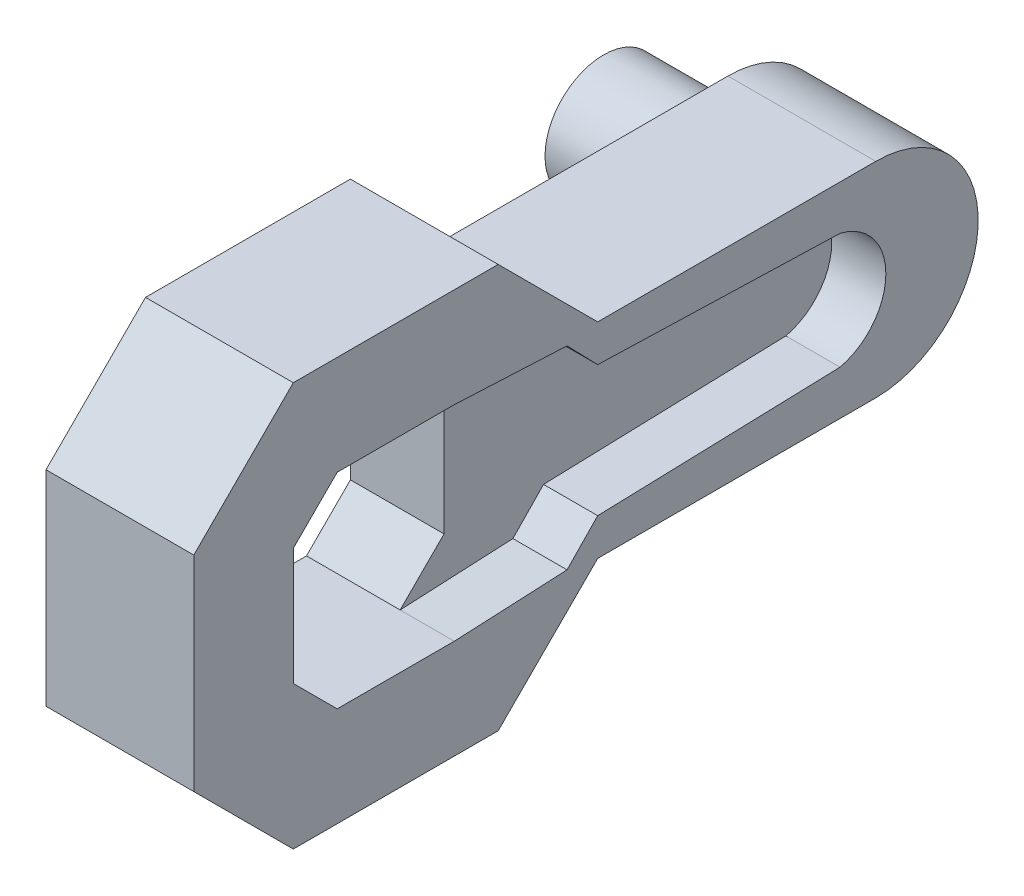
ISO-10303-21;
HEADER;
FILE_DESCRIPTION(('STEP AP214'),'2;1');
FILE_NAME('part.step','',(''),(''),'','','');
FILE_SCHEMA(('AUTOMOTIVE_DESIGN { 1 0 10303 214 1 1 1 1 }'));
ENDSEC;
DATA;
#1=APPLICATION_CONTEXT('core data for automotive mechanical design processes');
#2=APPLICATION_PROTOCOL_DEFINITION('international standard','automotive_design',2000,#1);
#3=PRODUCT_CONTEXT('',#1,'mechanical');
#4=PRODUCT('Part','Part','',(#3));
#5=PRODUCT_RELATED_PRODUCT_CATEGORY('part','',(#4));
#6=PRODUCT_DEFINITION_FORMATION('','',#4);
#7=PRODUCT_DEFINITION_CONTEXT('part definition',#1,'design');
#8=PRODUCT_DEFINITION('design','',#6,#7);
#9=PRODUCT_DEFINITION_SHAPE('','',#8);
#10=(LENGTH_UNIT() NAMED_UNIT(*) SI_UNIT(.MILLI.,.METRE.));
#11=(NAMED_UNIT(*) PLANE_ANGLE_UNIT() SI_UNIT($,.RADIAN.));
#12=(NAMED_UNIT(*) SI_UNIT($,.STERADIAN.) SOLID_ANGLE_UNIT());
#13=UNCERTAINTY_MEASURE_WITH_UNIT(LENGTH_MEASURE(1.E-05),#10,'distance_accuracy_value','');
#14=(GEOMETRIC_REPRESENTATION_CONTEXT(3) GLOBAL_UNCERTAINTY_ASSIGNED_CONTEXT((#13)) GLOBAL_UNIT_ASSIGNED_CONTEXT((#10,
#11,#12)) REPRESENTATION_CONTEXT('',''));
#15=CARTESIAN_POINT('',(0.,0.,0.));
#16=DIRECTION('',(0.,0.,1.));
#17=DIRECTION('',(1.,0.,0.));
#18=AXIS2_PLACEMENT_3D('',#15,#16,#17);
#19=CARTESIAN_POINT('',(3.2,0.,0.));
#20=DIRECTION('',(1.,0.,0.));
#21=DIRECTION('',(0.,0.,-1.));
#22=AXIS2_PLACEMENT_3D('',#19,#20,#21);
#23=PLANE('',#22);
#24=DIRECTION('',(0.,0.707106781186544,-0.707106781186551));
#25=VECTOR('',#24,1.);
#26=CARTESIAN_POINT('',(3.2,-3.5,-1.99999999999999));
#27=LINE('',#26,#25);
#28=CARTESIAN_POINT('',(3.2,-2.00000000000001,-3.5));
#29=VERTEX_POINT('',#28);
#30=CARTESIAN_POINT('',(3.2,-3.5,-1.99999999999999));
#31=VERTEX_POINT('',#30);
#32=EDGE_CURVE('E400',#29,#31,#27,.F.);
#33=ORIENTED_EDGE('',*,*,#32,.T.);
#34=DIRECTION('',(0.,-0.0481321510759977,0.998840976348486));
#35=VECTOR('',#34,1.);
#36=CARTESIAN_POINT('',(3.2,-3.58804426566379,-0.172900684645164));
#37=LINE('',#36,#35);
#38=CARTESIAN_POINT('',(3.2,-3.31433472381521,-5.85293575276977));
#39=VERTEX_POINT('',#38);
#40=EDGE_CURVE('E249',#39,#31,#37,.T.);
#41=ORIENTED_EDGE('',*,*,#40,.F.);
#42=DIRECTION('',(0.,-0.717900092453598,0.696146146477243));
#43=VECTOR('',#42,1.);
#44=CARTESIAN_POINT('',(3.2,-2.23455065304895,-6.90000000000001));
#45=LINE('',#44,#43);
#46=CARTESIAN_POINT('',(3.2,-2.23455065304895,-6.90000000000001));
#47=VERTEX_POINT('',#46);
#48=EDGE_CURVE('E301',#47,#39,#45,.T.);
#49=ORIENTED_EDGE('',*,*,#48,.F.);
#50=DIRECTION('',(0.,-0.0307610854897689,0.999526765834458));
#51=VECTOR('',#50,1.);
#52=CARTESIAN_POINT('',(3.2,-2.23455065304895,-6.90000000000001));
#53=LINE('',#52,#51);
#54=CARTESIAN_POINT('',(3.2,-1.97976035461889,-15.1789576148247));
#55=VERTEX_POINT('',#54);
#56=EDGE_CURVE('E317',#55,#47,#53,.T.);
#57=ORIENTED_EDGE('',*,*,#56,.F.);
#58=CARTESIAN_POINT('',(3.2,0.,-14.7117047366577));
#59=DIRECTION('',(-1.,0.,0.));
#60=DIRECTION('',(0.,0.,-1.));
#61=AXIS2_PLACEMENT_3D('',#58,#59,#60);
#62=CIRCLE('',#61,2.03415248048815);
#63=CARTESIAN_POINT('',(3.2,1.97976035461889,-15.1789576148247));
#64=VERTEX_POINT('',#63);
#65=EDGE_CURVE('E315',#64,#55,#62,.T.);
#66=ORIENTED_EDGE('',*,*,#65,.F.);
#67=DIRECTION('',(0.,-0.0307610854897688,-0.999526765834458));
#68=VECTOR('',#67,1.);
#69=CARTESIAN_POINT('',(3.2,2.23455065304895,-6.90000000000001));
#70=LINE('',#69,#68);
#71=CARTESIAN_POINT('',(3.2,2.23455065304895,-6.90000000000001));
#72=VERTEX_POINT('',#71);
#73=EDGE_CURVE('E313',#72,#64,#70,.T.);
#74=ORIENTED_EDGE('',*,*,#73,.F.);
#75=DIRECTION('',(0.,-0.717900092453598,-0.696146146477243));
#76=VECTOR('',#75,1.);
#77=CARTESIAN_POINT('',(3.2,2.23455065304895,-6.90000000000001));
#78=LINE('',#77,#76);
#79=CARTESIAN_POINT('',(3.2,3.31433472381521,-5.85293575276977));
#80=VERTEX_POINT('',#79);
#81=EDGE_CURVE('E296',#80,#72,#78,.T.);
#82=ORIENTED_EDGE('',*,*,#81,.F.);
#83=DIRECTION('',(0.,0.0481321510759978,0.998840976348486));
#84=VECTOR('',#83,1.);
#85=CARTESIAN_POINT('',(3.2,3.5880442656638,-0.172900684645164));
#86=LINE('',#85,#84);
#87=CARTESIAN_POINT('',(3.2,3.5,-2.00000000000001));
#88=VERTEX_POINT('',#87);
#89=EDGE_CURVE('E246',#80,#88,#86,.T.);
#90=ORIENTED_EDGE('',*,*,#89,.T.);
#91=DIRECTION('',(0.,0.707106781186551,0.707106781186544));
#92=VECTOR('',#91,1.);
#93=CARTESIAN_POINT('',(3.2,2.,-3.5));
#94=LINE('',#93,#92);
#95=CARTESIAN_POINT('',(3.2,2.,-3.5));
#96=VERTEX_POINT('',#95);
#97=EDGE_CURVE('E396',#88,#96,#94,.F.);
#98=ORIENTED_EDGE('',*,*,#97,.T.);
#99=DIRECTION('',(0.,1.,0.));
#100=VECTOR('',#99,1.);
#101=CARTESIAN_POINT('',(3.2,-3.5,-3.5));
#102=LINE('',#101,#100);
#103=EDGE_CURVE('E340',#29,#96,#102,.T.);
#104=ORIENTED_EDGE('',*,*,#103,.F.);
#105=EDGE_LOOP('',(#33,#41,#49,#57,#66,#74,#82,#90,#98,#104));
#106=FACE_BOUND('',#105,.T.);
#107=ADVANCED_FACE('F44',(#106),#23,.T.);
#108=CARTESIAN_POINT('',(0.,0.,0.));
#109=DIRECTION('',(1.,0.,0.));
#110=DIRECTION('',(0.,0.,-1.));
#111=AXIS2_PLACEMENT_3D('',#108,#109,#110);
#112=PLANE('',#111);
#113=CARTESIAN_POINT('',(0.,0.,-16.4));
#114=DIRECTION('',(1.,0.,0.));
#115=DIRECTION('',(0.,0.,-1.));
#116=AXIS2_PLACEMENT_3D('',#113,#114,#115);
#117=CIRCLE('',#116,2.);
#118=CARTESIAN_POINT('',(0.,0.,-18.4));
#119=VERTEX_POINT('',#118);
#120=EDGE_CURVE('E11',#119,#119,#117,.F.);
#121=ORIENTED_EDGE('',*,*,#120,.F.);
#122=EDGE_LOOP('',(#121));
#123=FACE_BOUND('',#122,.T.);
#124=DIRECTION('',(0.,0.,-1.));
#125=VECTOR('',#124,1.);
#126=CARTESIAN_POINT('',(0.,-3.5,-6.90000000000001));
#127=LINE('',#126,#125);
#128=CARTESIAN_POINT('',(0.,-3.5,-6.90000000000001));
#129=VERTEX_POINT('',#128);
#130=CARTESIAN_POINT('',(0.,-3.5,-16.4));
#131=VERTEX_POINT('',#130);
#132=EDGE_CURVE('E362',#129,#131,#127,.T.);
#133=ORIENTED_EDGE('',*,*,#132,.F.);
#134=DIRECTION('',(0.,0.707106781186546,-0.707106781186549));
#135=VECTOR('',#134,1.);
#136=CARTESIAN_POINT('',(0.,-3.5,-6.90000000000001));
#137=LINE('',#136,#135);
#138=CARTESIAN_POINT('',(0.,-6.9,-3.49999999999999));
#139=VERTEX_POINT('',#138);
#140=EDGE_CURVE('E230',#129,#139,#137,.F.);
#141=ORIENTED_EDGE('',*,*,#140,.T.);
#142=DIRECTION('',(0.,0.,-1.));
#143=VECTOR('',#142,1.);
#144=CARTESIAN_POINT('',(0.,-6.9,6.9));
#145=LINE('',#144,#143);
#146=CARTESIAN_POINT('',(0.,-6.9,3.5));
#147=VERTEX_POINT('',#146);
#148=EDGE_CURVE('E360',#147,#139,#145,.T.);
#149=ORIENTED_EDGE('',*,*,#148,.F.);
#150=DIRECTION('',(0.,-0.707106781186549,-0.707106781186546));
#151=VECTOR('',#150,1.);
#152=CARTESIAN_POINT('',(0.,-6.9,3.5));
#153=LINE('',#152,#151);
#154=CARTESIAN_POINT('',(0.,-3.49999999999999,6.9));
#155=VERTEX_POINT('',#154);
#156=EDGE_CURVE('E225',#147,#155,#153,.F.);
#157=ORIENTED_EDGE('',*,*,#156,.T.);
#158=DIRECTION('',(0.,-1.,0.));
#159=VECTOR('',#158,1.);
#160=CARTESIAN_POINT('',(0.,-6.9,6.9));
#161=LINE('',#160,#159);
#162=CARTESIAN_POINT('',(0.,3.5,6.9));
#163=VERTEX_POINT('',#162);
#164=EDGE_CURVE('E357',#163,#155,#161,.T.);
#165=ORIENTED_EDGE('',*,*,#164,.F.);
#166=DIRECTION('',(0.,-0.707106781186546,0.707106781186549));
#167=VECTOR('',#166,1.);
#168=CARTESIAN_POINT('',(0.,3.50000000000001,6.9));
#169=LINE('',#168,#167);
#170=CARTESIAN_POINT('',(0.,6.9,3.49999999999999));
#171=VERTEX_POINT('',#170);
#172=EDGE_CURVE('E60',#163,#171,#169,.F.);
#173=ORIENTED_EDGE('',*,*,#172,.T.);
#174=DIRECTION('',(0.,0.,1.));
#175=VECTOR('',#174,1.);
#176=CARTESIAN_POINT('',(0.,6.9,6.9));
#177=LINE('',#176,#175);
#178=CARTESIAN_POINT('',(0.,6.9,-3.50000000000001));
#179=VERTEX_POINT('',#178);
#180=EDGE_CURVE('E343',#179,#171,#177,.T.);
#181=ORIENTED_EDGE('',*,*,#180,.F.);
#182=DIRECTION('',(0.,0.707106781186548,0.707106781186547));
#183=VECTOR('',#182,1.);
#184=CARTESIAN_POINT('',(0.,6.9,-3.50000000000001));
#185=LINE('',#184,#183);
#186=CARTESIAN_POINT('',(0.,3.5,-6.90000000000001));
#187=VERTEX_POINT('',#186);
#188=EDGE_CURVE('E68',#179,#187,#185,.F.);
#189=ORIENTED_EDGE('',*,*,#188,.T.);
#190=DIRECTION('',(0.,0.,1.));
#191=VECTOR('',#190,1.);
#192=CARTESIAN_POINT('',(0.,3.5,-6.90000000000001));
#193=LINE('',#192,#191);
#194=CARTESIAN_POINT('',(0.,3.5,-16.4));
#195=VERTEX_POINT('',#194);
#196=EDGE_CURVE('E365',#195,#187,#193,.T.);
#197=ORIENTED_EDGE('',*,*,#196,.F.);
#198=CARTESIAN_POINT('',(0.,0.,-16.4));
#199=DIRECTION('',(1.,0.,0.));
#200=DIRECTION('',(0.,0.,-1.));
#201=AXIS2_PLACEMENT_3D('',#198,#199,#200);
#202=CIRCLE('',#201,3.5);
#203=CARTESIAN_POINT('',(0.,0.,-19.9));
#204=VERTEX_POINT('',#203);
#205=EDGE_CURVE('E407',#195,#204,#202,.F.);
#206=ORIENTED_EDGE('',*,*,#205,.T.);
#207=CARTESIAN_POINT('',(0.,0.,-16.4));
#208=DIRECTION('',(1.,0.,0.));
#209=DIRECTION('',(0.,0.,-1.));
#210=AXIS2_PLACEMENT_3D('',#207,#208,#209);
#211=CIRCLE('',#210,3.5);
#212=EDGE_CURVE('E409',#204,#131,#211,.F.);
#213=ORIENTED_EDGE('',*,*,#212,.T.);
#214=EDGE_LOOP('',(#133,#141,#149,#157,#165,#173,#181,#189,#197,#206,#213));
#215=FACE_BOUND('',#214,.T.);
#216=DIRECTION('',(0.,0.,-1.));
#217=VECTOR('',#216,1.);
#218=CARTESIAN_POINT('',(0.,-3.5,3.5));
#219=LINE('',#218,#217);
#220=CARTESIAN_POINT('',(0.,-3.5,2.));
#221=VERTEX_POINT('',#220);
#222=CARTESIAN_POINT('',(0.,-3.5,-1.99999999999999));
#223=VERTEX_POINT('',#222);
#224=EDGE_CURVE('E344',#221,#223,#219,.T.);
#225=ORIENTED_EDGE('',*,*,#224,.T.);
#226=DIRECTION('',(0.,-0.707106781186544,0.707106781186551));
#227=VECTOR('',#226,1.);
#228=CARTESIAN_POINT('',(0.,-2.75000000000001,-2.74999999999999));
#229=LINE('',#228,#227);
#230=CARTESIAN_POINT('',(0.,-2.00000000000001,-3.5));
#231=VERTEX_POINT('',#230);
#232=EDGE_CURVE('E398',#223,#231,#229,.F.);
#233=ORIENTED_EDGE('',*,*,#232,.T.);
#234=DIRECTION('',(0.,1.,0.));
#235=VECTOR('',#234,1.);
#236=CARTESIAN_POINT('',(0.,-3.5,-3.5));
#237=LINE('',#236,#235);
#238=CARTESIAN_POINT('',(0.,2.,-3.5));
#239=VERTEX_POINT('',#238);
#240=EDGE_CURVE('E345',#231,#239,#237,.T.);
#241=ORIENTED_EDGE('',*,*,#240,.T.);
#242=DIRECTION('',(0.,-0.707106781186551,-0.707106781186544));
#243=VECTOR('',#242,1.);
#244=CARTESIAN_POINT('',(0.,2.74999999999999,-2.75000000000001));
#245=LINE('',#244,#243);
#246=CARTESIAN_POINT('',(0.,3.5,-2.00000000000001));
#247=VERTEX_POINT('',#246);
#248=EDGE_CURVE('E394',#239,#247,#245,.F.);
#249=ORIENTED_EDGE('',*,*,#248,.T.);
#250=DIRECTION('',(0.,0.,1.));
#251=VECTOR('',#250,1.);
#252=CARTESIAN_POINT('',(0.,3.5,3.5));
#253=LINE('',#252,#251);
#254=CARTESIAN_POINT('',(0.,3.5,1.99999999999999));
#255=VERTEX_POINT('',#254);
#256=EDGE_CURVE('E348',#247,#255,#253,.T.);
#257=ORIENTED_EDGE('',*,*,#256,.T.);
#258=DIRECTION('',(0.,0.707106781186544,-0.707106781186551));
#259=VECTOR('',#258,1.);
#260=CARTESIAN_POINT('',(0.,2.75000000000001,2.74999999999999));
#261=LINE('',#260,#259);
#262=CARTESIAN_POINT('',(0.,2.00000000000001,3.5));
#263=VERTEX_POINT('',#262);
#264=EDGE_CURVE('E405',#255,#263,#261,.F.);
#265=ORIENTED_EDGE('',*,*,#264,.T.);
#266=DIRECTION('',(0.,-1.,0.));
#267=VECTOR('',#266,1.);
#268=CARTESIAN_POINT('',(0.,-3.5,3.5));
#269=LINE('',#268,#267);
#270=CARTESIAN_POINT('',(0.,-1.99999999999999,3.5));
#271=VERTEX_POINT('',#270);
#272=EDGE_CURVE('E351',#263,#271,#269,.T.);
#273=ORIENTED_EDGE('',*,*,#272,.T.);
#274=DIRECTION('',(0.,0.707106781186551,0.707106781186544));
#275=VECTOR('',#274,1.);
#276=CARTESIAN_POINT('',(0.,-2.74999999999999,2.75000000000001));
#277=LINE('',#276,#275);
#278=EDGE_CURVE('E403',#271,#221,#277,.F.);
#279=ORIENTED_EDGE('',*,*,#278,.T.);
#280=EDGE_LOOP('',(#225,#233,#241,#249,#257,#265,#273,#279));
#281=FACE_BOUND('',#280,.T.);
#282=ADVANCED_FACE('F438',(#123,#215,#281),#112,.F.);
#283=CARTESIAN_POINT('',(3.2,6.9,6.9));
#284=DIRECTION('',(0.,-1.,0.));
#285=DIRECTION('',(0.,0.,-1.));
#286=AXIS2_PLACEMENT_3D('',#283,#284,#285);
#287=PLANE('',#286);
#288=ORIENTED_EDGE('',*,*,#180,.T.);
#289=DIRECTION('',(1.,0.,0.));
#290=VECTOR('',#289,1.);
#291=CARTESIAN_POINT('',(3.2,6.9,3.49999999999999));
#292=LINE('',#291,#290);
#293=CARTESIAN_POINT('',(5.05,6.9,3.49999999999999));
#294=VERTEX_POINT('',#293);
#295=EDGE_CURVE('E53',#171,#294,#292,.T.);
#296=ORIENTED_EDGE('',*,*,#295,.T.);
#297=DIRECTION('',(0.,0.,1.));
#298=VECTOR('',#297,1.);
#299=CARTESIAN_POINT('',(5.05,6.9,0.));
#300=LINE('',#299,#298);
#301=CARTESIAN_POINT('',(5.05,6.9,-3.5));
#302=VERTEX_POINT('',#301);
#303=EDGE_CURVE('E265',#302,#294,#300,.T.);
#304=ORIENTED_EDGE('',*,*,#303,.F.);
#305=DIRECTION('',(-1.,0.,0.));
#306=VECTOR('',#305,1.);
#307=CARTESIAN_POINT('',(3.2,6.9,-3.50000000000001));
#308=LINE('',#307,#306);
#309=EDGE_CURVE('E426',#302,#179,#308,.T.);
#310=ORIENTED_EDGE('',*,*,#309,.T.);
#311=EDGE_LOOP('',(#288,#296,#304,#310));
#312=FACE_BOUND('',#311,.T.);
#313=ADVANCED_FACE('F430',(#312),#287,.F.);
#314=CARTESIAN_POINT('',(3.2,-6.9,6.9));
#315=DIRECTION('',(0.,0.,-1.));
#316=DIRECTION('',(-1.,0.,0.));
#317=AXIS2_PLACEMENT_3D('',#314,#315,#316);
#318=PLANE('',#317);
#319=ORIENTED_EDGE('',*,*,#164,.T.);
#320=DIRECTION('',(1.,0.,0.));
#321=VECTOR('',#320,1.);
#322=CARTESIAN_POINT('',(3.2,-3.49999999999999,6.9));
#323=LINE('',#322,#321);
#324=CARTESIAN_POINT('',(5.05,-3.49999999999999,6.9));
#325=VERTEX_POINT('',#324);
#326=EDGE_CURVE('E424',#155,#325,#323,.T.);
#327=ORIENTED_EDGE('',*,*,#326,.T.);
#328=DIRECTION('',(0.,-1.,0.));
#329=VECTOR('',#328,1.);
#330=CARTESIAN_POINT('',(5.05,0.,6.9));
#331=LINE('',#330,#329);
#332=CARTESIAN_POINT('',(5.05,3.5,6.9));
#333=VERTEX_POINT('',#332);
#334=EDGE_CURVE('E245',#333,#325,#331,.T.);
#335=ORIENTED_EDGE('',*,*,#334,.F.);
#336=DIRECTION('',(-1.,0.,0.));
#337=VECTOR('',#336,1.);
#338=CARTESIAN_POINT('',(3.2,3.50000000000001,6.9));
#339=LINE('',#338,#337);
#340=EDGE_CURVE('E421',#333,#163,#339,.T.);
#341=ORIENTED_EDGE('',*,*,#340,.T.);
#342=EDGE_LOOP('',(#319,#327,#335,#341));
#343=FACE_BOUND('',#342,.T.);
#344=ADVANCED_FACE('F436',(#343),#318,.F.);
#345=CARTESIAN_POINT('',(3.2,-6.9,6.9));
#346=DIRECTION('',(0.,1.,0.));
#347=DIRECTION('',(0.,0.,1.));
#348=AXIS2_PLACEMENT_3D('',#345,#346,#347);
#349=PLANE('',#348);
#350=ORIENTED_EDGE('',*,*,#148,.T.);
#351=DIRECTION('',(1.,0.,0.));
#352=VECTOR('',#351,1.);
#353=CARTESIAN_POINT('',(3.2,-6.9,-3.5));
#354=LINE('',#353,#352);
#355=CARTESIAN_POINT('',(5.05,-6.9,-3.49999999999999));
#356=VERTEX_POINT('',#355);
#357=EDGE_CURVE('E229',#139,#356,#354,.T.);
#358=ORIENTED_EDGE('',*,*,#357,.T.);
#359=DIRECTION('',(0.,0.,-1.));
#360=VECTOR('',#359,1.);
#361=CARTESIAN_POINT('',(5.05,-6.9,0.));
#362=LINE('',#361,#360);
#363=CARTESIAN_POINT('',(5.05,-6.9,3.5));
#364=VERTEX_POINT('',#363);
#365=EDGE_CURVE('E233',#364,#356,#362,.T.);
#366=ORIENTED_EDGE('',*,*,#365,.F.);
#367=DIRECTION('',(-1.,0.,0.));
#368=VECTOR('',#367,1.);
#369=CARTESIAN_POINT('',(3.2,-6.9,3.5));
#370=LINE('',#369,#368);
#371=EDGE_CURVE('E219',#364,#147,#370,.T.);
#372=ORIENTED_EDGE('',*,*,#371,.T.);
#373=EDGE_LOOP('',(#350,#358,#366,#372));
#374=FACE_BOUND('',#373,.T.);
#375=ADVANCED_FACE('F234',(#374),#349,.F.);
#376=CARTESIAN_POINT('',(3.2,-3.5,-6.90000000000001));
#377=DIRECTION('',(0.,1.,0.));
#378=DIRECTION('',(0.,0.,1.));
#379=AXIS2_PLACEMENT_3D('',#376,#377,#378);
#380=PLANE('',#379);
#381=ORIENTED_EDGE('',*,*,#132,.T.);
#382=DIRECTION('',(-1.,0.,0.));
#383=VECTOR('',#382,1.);
#384=CARTESIAN_POINT('',(3.2,-3.5,-16.4));
#385=LINE('',#384,#383);
#386=CARTESIAN_POINT('',(5.05,-3.5,-16.4));
#387=VERTEX_POINT('',#386);
#388=EDGE_CURVE('E411',#131,#387,#385,.F.);
#389=ORIENTED_EDGE('',*,*,#388,.T.);
#390=DIRECTION('',(0.,0.,-1.));
#391=VECTOR('',#390,1.);
#392=CARTESIAN_POINT('',(5.05,-3.5,0.));
#393=LINE('',#392,#391);
#394=CARTESIAN_POINT('',(5.05,-3.5,-6.90000000000001));
#395=VERTEX_POINT('',#394);
#396=EDGE_CURVE('E253',#395,#387,#393,.T.);
#397=ORIENTED_EDGE('',*,*,#396,.F.);
#398=DIRECTION('',(-1.,0.,0.));
#399=VECTOR('',#398,1.);
#400=CARTESIAN_POINT('',(3.2,-3.5,-6.90000000000001));
#401=LINE('',#400,#399);
#402=EDGE_CURVE('E370',#395,#129,#401,.T.);
#403=ORIENTED_EDGE('',*,*,#402,.T.);
#404=EDGE_LOOP('',(#381,#389,#397,#403));
#405=FACE_BOUND('',#404,.T.);
#406=ADVANCED_FACE('F445',(#405),#380,.F.);
#407=CARTESIAN_POINT('',(3.2,3.5,-6.90000000000001));
#408=DIRECTION('',(0.,-1.,0.));
#409=DIRECTION('',(0.,0.,-1.));
#410=AXIS2_PLACEMENT_3D('',#407,#408,#409);
#411=PLANE('',#410);
#412=DIRECTION('',(-1.,0.,0.));
#413=VECTOR('',#412,1.);
#414=CARTESIAN_POINT('',(3.2,3.5,-6.90000000000001));
#415=LINE('',#414,#413);
#416=CARTESIAN_POINT('',(5.05,3.5,-6.90000000000001));
#417=VERTEX_POINT('',#416);
#418=EDGE_CURVE('E368',#417,#187,#415,.T.);
#419=ORIENTED_EDGE('',*,*,#418,.F.);
#420=DIRECTION('',(0.,0.,1.));
#421=VECTOR('',#420,1.);
#422=CARTESIAN_POINT('',(5.05,3.5,0.));
#423=LINE('',#422,#421);
#424=CARTESIAN_POINT('',(5.05,3.5,-16.4));
#425=VERTEX_POINT('',#424);
#426=EDGE_CURVE('E259',#425,#417,#423,.T.);
#427=ORIENTED_EDGE('',*,*,#426,.F.);
#428=DIRECTION('',(-1.,0.,0.));
#429=VECTOR('',#428,1.);
#430=CARTESIAN_POINT('',(3.2,3.5,-16.4));
#431=LINE('',#430,#429);
#432=EDGE_CURVE('E413',#425,#195,#431,.T.);
#433=ORIENTED_EDGE('',*,*,#432,.T.);
#434=ORIENTED_EDGE('',*,*,#196,.T.);
#435=EDGE_LOOP('',(#419,#427,#433,#434));
#436=FACE_BOUND('',#435,.T.);
#437=ADVANCED_FACE('F453',(#436),#411,.F.);
#438=CARTESIAN_POINT('',(3.2,-3.5,-3.5));
#439=DIRECTION('',(0.,0.,1.));
#440=DIRECTION('',(1.,0.,0.));
#441=AXIS2_PLACEMENT_3D('',#438,#439,#440);
#442=PLANE('',#441);
#443=ORIENTED_EDGE('',*,*,#103,.T.);
#444=DIRECTION('',(-1.,0.,0.));
#445=VECTOR('',#444,1.);
#446=CARTESIAN_POINT('',(0.,2.,-3.5));
#447=LINE('',#446,#445);
#448=EDGE_CURVE('E375',#96,#239,#447,.T.);
#449=ORIENTED_EDGE('',*,*,#448,.T.);
#450=ORIENTED_EDGE('',*,*,#240,.F.);
#451=DIRECTION('',(1.,0.,0.));
#452=VECTOR('',#451,1.);
#453=CARTESIAN_POINT('',(3.2,-2.00000000000001,-3.5));
#454=LINE('',#453,#452);
#455=EDGE_CURVE('E373',#231,#29,#454,.T.);
#456=ORIENTED_EDGE('',*,*,#455,.T.);
#457=EDGE_LOOP('',(#443,#449,#450,#456));
#458=FACE_BOUND('',#457,.T.);
#459=ADVANCED_FACE('F474',(#458),#442,.T.);
#460=CARTESIAN_POINT('',(3.2,3.5,3.5));
#461=DIRECTION('',(0.,-1.,0.));
#462=DIRECTION('',(0.,0.,-1.));
#463=AXIS2_PLACEMENT_3D('',#460,#461,#462);
#464=PLANE('',#463);
#465=ORIENTED_EDGE('',*,*,#256,.F.);
#466=DIRECTION('',(1.,0.,0.));
#467=VECTOR('',#466,1.);
#468=CARTESIAN_POINT('',(3.2,3.5,-2.00000000000001));
#469=LINE('',#468,#467);
#470=EDGE_CURVE('E381',#247,#88,#469,.T.);
#471=ORIENTED_EDGE('',*,*,#470,.T.);
#472=DIRECTION('',(-1.,0.,0.));
#473=VECTOR('',#472,1.);
#474=CARTESIAN_POINT('',(5.05,3.5,-2.00000000000001));
#475=LINE('',#474,#473);
#476=CARTESIAN_POINT('',(5.05,3.5,-2.00000000000001));
#477=VERTEX_POINT('',#476);
#478=EDGE_CURVE('E290',#477,#88,#475,.T.);
#479=ORIENTED_EDGE('',*,*,#478,.F.);
#480=DIRECTION('',(0.,0.,-1.));
#481=VECTOR('',#480,1.);
#482=CARTESIAN_POINT('',(5.05,3.5,0.));
#483=LINE('',#482,#481);
#484=CARTESIAN_POINT('',(5.05,3.5,1.99999999999999));
#485=VERTEX_POINT('',#484);
#486=EDGE_CURVE('E285',#485,#477,#483,.T.);
#487=ORIENTED_EDGE('',*,*,#486,.F.);
#488=DIRECTION('',(-1.,0.,0.));
#489=VECTOR('',#488,1.);
#490=CARTESIAN_POINT('',(0.,3.5,1.99999999999999));
#491=LINE('',#490,#489);
#492=EDGE_CURVE('E378',#485,#255,#491,.T.);
#493=ORIENTED_EDGE('',*,*,#492,.T.);
#494=EDGE_LOOP('',(#465,#471,#479,#487,#493));
#495=FACE_BOUND('',#494,.T.);
#496=ADVANCED_FACE('F624',(#495),#464,.T.);
#497=CARTESIAN_POINT('',(3.2,-3.5,3.5));
#498=DIRECTION('',(0.,0.,-1.));
#499=DIRECTION('',(-1.,0.,0.));
#500=AXIS2_PLACEMENT_3D('',#497,#498,#499);
#501=PLANE('',#500);
#502=DIRECTION('',(1.,0.,0.));
#503=VECTOR('',#502,1.);
#504=CARTESIAN_POINT('',(3.2,2.00000000000001,3.5));
#505=LINE('',#504,#503);
#506=CARTESIAN_POINT('',(5.05,2.00000000000001,3.5));
#507=VERTEX_POINT('',#506);
#508=EDGE_CURVE('E389',#263,#507,#505,.T.);
#509=ORIENTED_EDGE('',*,*,#508,.T.);
#510=DIRECTION('',(0.,1.,0.));
#511=VECTOR('',#510,1.);
#512=CARTESIAN_POINT('',(5.05,0.,3.5));
#513=LINE('',#512,#511);
#514=CARTESIAN_POINT('',(5.05,-1.99999999999999,3.5));
#515=VERTEX_POINT('',#514);
#516=EDGE_CURVE('E279',#515,#507,#513,.T.);
#517=ORIENTED_EDGE('',*,*,#516,.F.);
#518=DIRECTION('',(-1.,0.,0.));
#519=VECTOR('',#518,1.);
#520=CARTESIAN_POINT('',(0.,-1.99999999999999,3.5));
#521=LINE('',#520,#519);
#522=EDGE_CURVE('E391',#515,#271,#521,.T.);
#523=ORIENTED_EDGE('',*,*,#522,.T.);
#524=ORIENTED_EDGE('',*,*,#272,.F.);
#525=EDGE_LOOP('',(#509,#517,#523,#524));
#526=FACE_BOUND('',#525,.T.);
#527=ADVANCED_FACE('F621',(#526),#501,.T.);
#528=CARTESIAN_POINT('',(3.2,-3.5,3.5));
#529=DIRECTION('',(0.,1.,0.));
#530=DIRECTION('',(0.,0.,1.));
#531=AXIS2_PLACEMENT_3D('',#528,#529,#530);
#532=PLANE('',#531);
#533=DIRECTION('',(1.,0.,0.));
#534=VECTOR('',#533,1.);
#535=CARTESIAN_POINT('',(3.2,-3.5,2.));
#536=LINE('',#535,#534);
#537=CARTESIAN_POINT('',(5.05,-3.5,2.));
#538=VERTEX_POINT('',#537);
#539=EDGE_CURVE('E384',#221,#538,#536,.T.);
#540=ORIENTED_EDGE('',*,*,#539,.T.);
#541=DIRECTION('',(0.,0.,1.));
#542=VECTOR('',#541,1.);
#543=CARTESIAN_POINT('',(5.05,-3.5,0.));
#544=LINE('',#543,#542);
#545=CARTESIAN_POINT('',(5.05,-3.5,-1.99999999999999));
#546=VERTEX_POINT('',#545);
#547=EDGE_CURVE('E273',#546,#538,#544,.T.);
#548=ORIENTED_EDGE('',*,*,#547,.F.);
#549=DIRECTION('',(-1.,0.,0.));
#550=VECTOR('',#549,1.);
#551=CARTESIAN_POINT('',(5.05,-3.5,-1.99999999999999));
#552=LINE('',#551,#550);
#553=EDGE_CURVE('E293',#546,#31,#552,.T.);
#554=ORIENTED_EDGE('',*,*,#553,.T.);
#555=DIRECTION('',(-1.,0.,0.));
#556=VECTOR('',#555,1.);
#557=CARTESIAN_POINT('',(0.,-3.5,-1.99999999999999));
#558=LINE('',#557,#556);
#559=EDGE_CURVE('E386',#31,#223,#558,.T.);
#560=ORIENTED_EDGE('',*,*,#559,.T.);
#561=ORIENTED_EDGE('',*,*,#224,.F.);
#562=EDGE_LOOP('',(#540,#548,#554,#560,#561));
#563=FACE_BOUND('',#562,.T.);
#564=ADVANCED_FACE('F495',(#563),#532,.T.);
#565=CARTESIAN_POINT('',(3.2,2.,-3.5));
#566=DIRECTION('',(0.,-0.707106781186544,0.707106781186551));
#567=DIRECTION('',(1.,0.,0.));
#568=AXIS2_PLACEMENT_3D('',#565,#566,#567);
#569=PLANE('',#568);
#570=ORIENTED_EDGE('',*,*,#97,.F.);
#571=ORIENTED_EDGE('',*,*,#470,.F.);
#572=ORIENTED_EDGE('',*,*,#248,.F.);
#573=ORIENTED_EDGE('',*,*,#448,.F.);
#574=EDGE_LOOP('',(#570,#571,#572,#573));
#575=FACE_BOUND('',#574,.T.);
#576=ADVANCED_FACE('F488',(#575),#569,.T.);
#577=CARTESIAN_POINT('',(3.2,-3.5,-1.99999999999999));
#578=DIRECTION('',(0.,0.707106781186551,0.707106781186544));
#579=DIRECTION('',(1.,0.,0.));
#580=AXIS2_PLACEMENT_3D('',#577,#578,#579);
#581=PLANE('',#580);
#582=ORIENTED_EDGE('',*,*,#32,.F.);
#583=ORIENTED_EDGE('',*,*,#455,.F.);
#584=ORIENTED_EDGE('',*,*,#232,.F.);
#585=ORIENTED_EDGE('',*,*,#559,.F.);
#586=EDGE_LOOP('',(#582,#583,#584,#585));
#587=FACE_BOUND('',#586,.T.);
#588=ADVANCED_FACE('F494',(#587),#581,.T.);
#589=CARTESIAN_POINT('',(3.2,-1.99999999999999,3.5));
#590=DIRECTION('',(0.,0.707106781186544,-0.707106781186551));
#591=DIRECTION('',(1.,0.,0.));
#592=AXIS2_PLACEMENT_3D('',#589,#590,#591);
#593=PLANE('',#592);
#594=ORIENTED_EDGE('',*,*,#522,.F.);
#595=DIRECTION('',(0.,0.707106781186551,0.707106781186544));
#596=VECTOR('',#595,1.);
#597=CARTESIAN_POINT('',(5.05,-2.74999999999999,2.75000000000001));
#598=LINE('',#597,#596);
#599=EDGE_CURVE('E276',#538,#515,#598,.T.);
#600=ORIENTED_EDGE('',*,*,#599,.F.);
#601=ORIENTED_EDGE('',*,*,#539,.F.);
#602=ORIENTED_EDGE('',*,*,#278,.F.);
#603=EDGE_LOOP('',(#594,#600,#601,#602));
#604=FACE_BOUND('',#603,.T.);
#605=ADVANCED_FACE('F502',(#604),#593,.T.);
#606=CARTESIAN_POINT('',(3.2,3.5,1.99999999999999));
#607=DIRECTION('',(0.,-0.707106781186551,-0.707106781186544));
#608=DIRECTION('',(1.,0.,0.));
#609=AXIS2_PLACEMENT_3D('',#606,#607,#608);
#610=PLANE('',#609);
#611=ORIENTED_EDGE('',*,*,#492,.F.);
#612=DIRECTION('',(0.,0.707106781186544,-0.707106781186551));
#613=VECTOR('',#612,1.);
#614=CARTESIAN_POINT('',(5.05,2.75000000000001,2.74999999999999));
#615=LINE('',#614,#613);
#616=EDGE_CURVE('E282',#507,#485,#615,.T.);
#617=ORIENTED_EDGE('',*,*,#616,.F.);
#618=ORIENTED_EDGE('',*,*,#508,.F.);
#619=ORIENTED_EDGE('',*,*,#264,.F.);
#620=EDGE_LOOP('',(#611,#617,#618,#619));
#621=FACE_BOUND('',#620,.T.);
#622=ADVANCED_FACE('F509',(#621),#610,.T.);
#623=CARTESIAN_POINT('',(3.2,0.,-16.4));
#624=DIRECTION('',(-1.,0.,0.));
#625=DIRECTION('',(0.,0.,1.));
#626=AXIS2_PLACEMENT_3D('',#623,#624,#625);
#627=CYLINDRICAL_SURFACE('',#626,3.5);
#628=ORIENTED_EDGE('',*,*,#432,.F.);
#629=CARTESIAN_POINT('',(5.05,0.,-16.4));
#630=DIRECTION('',(1.,0.,0.));
#631=DIRECTION('',(0.,0.,-1.));
#632=AXIS2_PLACEMENT_3D('',#629,#630,#631);
#633=CIRCLE('',#632,3.5);
#634=EDGE_CURVE('E256',#387,#425,#633,.T.);
#635=ORIENTED_EDGE('',*,*,#634,.F.);
#636=ORIENTED_EDGE('',*,*,#388,.F.);
#637=ORIENTED_EDGE('',*,*,#212,.F.);
#638=DIRECTION('',(-1.,0.,0.));
#639=VECTOR('',#638,1.);
#640=CARTESIAN_POINT('',(3.2,0.,-19.9));
#641=LINE('',#640,#639);
#642=CARTESIAN_POINT('',(3.2,0.,-19.9));
#643=VERTEX_POINT('',#642);
#644=EDGE_CURVE('E339',#204,#643,#641,.F.);
#645=ORIENTED_EDGE('',*,*,#644,.T.);
#646=ORIENTED_EDGE('',*,*,#644,.F.);
#647=ORIENTED_EDGE('',*,*,#205,.F.);
#648=EDGE_LOOP('',(#628,#635,#636,#637,#645,#646,#647));
#649=FACE_BOUND('',#648,.T.);
#650=ADVANCED_FACE('F449',(#649),#627,.T.);
#651=CARTESIAN_POINT('',(3.2,-3.5,-6.90000000000001));
#652=DIRECTION('',(0.,0.707106781186549,0.707106781186546));
#653=DIRECTION('',(-1.,0.,0.));
#654=AXIS2_PLACEMENT_3D('',#651,#652,#653);
#655=PLANE('',#654);
#656=ORIENTED_EDGE('',*,*,#402,.F.);
#657=DIRECTION('',(0.,0.707106781186546,-0.707106781186549));
#658=VECTOR('',#657,1.);
#659=CARTESIAN_POINT('',(5.05,-5.20000000000001,-5.19999999999999));
#660=LINE('',#659,#658);
#661=EDGE_CURVE('E239',#356,#395,#660,.T.);
#662=ORIENTED_EDGE('',*,*,#661,.F.);
#663=ORIENTED_EDGE('',*,*,#357,.F.);
#664=ORIENTED_EDGE('',*,*,#140,.F.);
#665=EDGE_LOOP('',(#656,#662,#663,#664));
#666=FACE_BOUND('',#665,.T.);
#667=ADVANCED_FACE('F441',(#666),#655,.F.);
#668=CARTESIAN_POINT('',(3.2,-6.9,3.5));
#669=DIRECTION('',(0.,0.707106781186546,-0.707106781186549));
#670=DIRECTION('',(-1.,0.,0.));
#671=AXIS2_PLACEMENT_3D('',#668,#669,#670);
#672=PLANE('',#671);
#673=ORIENTED_EDGE('',*,*,#371,.F.);
#674=DIRECTION('',(0.,-0.707106781186549,-0.707106781186546));
#675=VECTOR('',#674,1.);
#676=CARTESIAN_POINT('',(5.05,-5.19999999999999,5.20000000000001));
#677=LINE('',#676,#675);
#678=EDGE_CURVE('E224',#325,#364,#677,.T.);
#679=ORIENTED_EDGE('',*,*,#678,.F.);
#680=ORIENTED_EDGE('',*,*,#326,.F.);
#681=ORIENTED_EDGE('',*,*,#156,.F.);
#682=EDGE_LOOP('',(#673,#679,#680,#681));
#683=FACE_BOUND('',#682,.T.);
#684=ADVANCED_FACE('F221',(#683),#672,.F.);
#685=CARTESIAN_POINT('',(3.2,3.50000000000001,6.9));
#686=DIRECTION('',(0.,-0.707106781186549,-0.707106781186546));
#687=DIRECTION('',(-1.,0.,0.));
#688=AXIS2_PLACEMENT_3D('',#685,#686,#687);
#689=PLANE('',#688);
#690=ORIENTED_EDGE('',*,*,#340,.F.);
#691=DIRECTION('',(0.,-0.707106781186546,0.707106781186549));
#692=VECTOR('',#691,1.);
#693=CARTESIAN_POINT('',(5.05,5.20000000000001,5.19999999999999));
#694=LINE('',#693,#692);
#695=EDGE_CURVE('E268',#294,#333,#694,.T.);
#696=ORIENTED_EDGE('',*,*,#695,.F.);
#697=ORIENTED_EDGE('',*,*,#295,.F.);
#698=ORIENTED_EDGE('',*,*,#172,.F.);
#699=EDGE_LOOP('',(#690,#696,#697,#698));
#700=FACE_BOUND('',#699,.T.);
#701=ADVANCED_FACE('F434',(#700),#689,.F.);
#702=CARTESIAN_POINT('',(3.2,6.9,-3.50000000000001));
#703=DIRECTION('',(0.,-0.707106781186547,0.707106781186548));
#704=DIRECTION('',(-1.,0.,0.));
#705=AXIS2_PLACEMENT_3D('',#702,#703,#704);
#706=PLANE('',#705);
#707=ORIENTED_EDGE('',*,*,#309,.F.);
#708=DIRECTION('',(0.,0.707106781186548,0.707106781186547));
#709=VECTOR('',#708,1.);
#710=CARTESIAN_POINT('',(5.05,5.2,-5.20000000000001));
#711=LINE('',#710,#709);
#712=EDGE_CURVE('E262',#417,#302,#711,.T.);
#713=ORIENTED_EDGE('',*,*,#712,.F.);
#714=ORIENTED_EDGE('',*,*,#418,.T.);
#715=ORIENTED_EDGE('',*,*,#188,.F.);
#716=EDGE_LOOP('',(#707,#713,#714,#715));
#717=FACE_BOUND('',#716,.T.);
#718=ADVANCED_FACE('F47',(#717),#706,.F.);
#719=CARTESIAN_POINT('',(-4.25,0.,-16.4));
#720=DIRECTION('',(1.,0.,0.));
#721=DIRECTION('',(0.,0.,-1.));
#722=AXIS2_PLACEMENT_3D('',#719,#720,#721);
#723=CYLINDRICAL_SURFACE('',#722,2.);
#724=CARTESIAN_POINT('',(-4.25,0.,-16.4));
#725=DIRECTION('',(-1.,0.,0.));
#726=DIRECTION('',(0.,0.,1.));
#727=AXIS2_PLACEMENT_3D('',#724,#725,#726);
#728=CIRCLE('',#727,2.);
#729=CARTESIAN_POINT('',(-4.25,0.,-14.4));
#730=VERTEX_POINT('',#729);
#731=EDGE_CURVE('E336',#730,#730,#728,.T.);
#732=ORIENTED_EDGE('',*,*,#731,.F.);
#733=EDGE_LOOP('',(#732));
#734=FACE_BOUND('',#733,.T.);
#735=ORIENTED_EDGE('',*,*,#120,.T.);
#736=EDGE_LOOP('',(#735));
#737=FACE_BOUND('',#736,.T.);
#738=ADVANCED_FACE('F457',(#734,#737),#723,.T.);
#739=CARTESIAN_POINT('',(-4.25,0.,-16.4));
#740=DIRECTION('',(-1.,0.,0.));
#741=DIRECTION('',(0.,0.,1.));
#742=AXIS2_PLACEMENT_3D('',#739,#740,#741);
#743=PLANE('',#742);
#744=ORIENTED_EDGE('',*,*,#731,.T.);
#745=EDGE_LOOP('',(#744));
#746=FACE_BOUND('',#745,.T.);
#747=ADVANCED_FACE('F462',(#746),#743,.T.);
#748=CARTESIAN_POINT('',(5.05,2.23455065304895,-6.90000000000001));
#749=DIRECTION('',(0.,0.696146146477243,-0.717900092453598));
#750=DIRECTION('',(0.,0.717900092453598,0.696146146477243));
#751=AXIS2_PLACEMENT_3D('',#748,#749,#750);
#752=PLANE('',#751);
#753=ORIENTED_EDGE('',*,*,#81,.T.);
#754=DIRECTION('',(-1.,0.,0.));
#755=VECTOR('',#754,1.);
#756=CARTESIAN_POINT('',(5.05,2.23455065304895,-6.90000000000001));
#757=LINE('',#756,#755);
#758=CARTESIAN_POINT('',(5.05,2.23455065304895,-6.90000000000001));
#759=VERTEX_POINT('',#758);
#760=EDGE_CURVE('E334',#759,#72,#757,.T.);
#761=ORIENTED_EDGE('',*,*,#760,.F.);
#762=DIRECTION('',(0.,-0.717900092453598,-0.696146146477243));
#763=VECTOR('',#762,1.);
#764=CARTESIAN_POINT('',(5.05,2.23455065304895,-6.90000000000001));
#765=LINE('',#764,#763);
#766=CARTESIAN_POINT('',(5.05,3.31433472381521,-5.85293575276977));
#767=VERTEX_POINT('',#766);
#768=EDGE_CURVE('E297',#767,#759,#765,.T.);
#769=ORIENTED_EDGE('',*,*,#768,.F.);
#770=DIRECTION('',(-1.,0.,0.));
#771=VECTOR('',#770,1.);
#772=CARTESIAN_POINT('',(5.05,3.31433472381521,-5.85293575276977));
#773=LINE('',#772,#771);
#774=EDGE_CURVE('E310',#767,#80,#773,.T.);
#775=ORIENTED_EDGE('',*,*,#774,.T.);
#776=EDGE_LOOP('',(#753,#761,#769,#775));
#777=FACE_BOUND('',#776,.T.);
#778=ADVANCED_FACE('F552',(#777),#752,.F.);
#779=CARTESIAN_POINT('',(5.05,2.23455065304895,-6.90000000000001));
#780=DIRECTION('',(0.,0.999526765834458,-0.0307610854897689));
#781=DIRECTION('',(0.,0.0307610854897689,0.999526765834458));
#782=AXIS2_PLACEMENT_3D('',#779,#780,#781);
#783=PLANE('',#782);
#784=ORIENTED_EDGE('',*,*,#73,.T.);
#785=DIRECTION('',(-1.,0.,0.));
#786=VECTOR('',#785,1.);
#787=CARTESIAN_POINT('',(5.05,1.97976035461889,-15.1789576148247));
#788=LINE('',#787,#786);
#789=CARTESIAN_POINT('',(5.05,1.97976035461889,-15.1789576148247));
#790=VERTEX_POINT('',#789);
#791=EDGE_CURVE('E331',#790,#64,#788,.T.);
#792=ORIENTED_EDGE('',*,*,#791,.F.);
#793=DIRECTION('',(0.,-0.0307610854897688,-0.999526765834458));
#794=VECTOR('',#793,1.);
#795=CARTESIAN_POINT('',(5.05,2.23455065304895,-6.90000000000001));
#796=LINE('',#795,#794);
#797=EDGE_CURVE('E300',#759,#790,#796,.T.);
#798=ORIENTED_EDGE('',*,*,#797,.F.);
#799=ORIENTED_EDGE('',*,*,#760,.T.);
#800=EDGE_LOOP('',(#784,#792,#798,#799));
#801=FACE_BOUND('',#800,.T.);
#802=ADVANCED_FACE('F557',(#801),#783,.F.);
#803=CARTESIAN_POINT('',(5.05,0.,-14.7117047366577));
#804=DIRECTION('',(-1.,0.,0.));
#805=DIRECTION('',(0.,0.,1.));
#806=AXIS2_PLACEMENT_3D('',#803,#804,#805);
#807=CYLINDRICAL_SURFACE('',#806,2.03415248048815);
#808=ORIENTED_EDGE('',*,*,#65,.T.);
#809=DIRECTION('',(-1.,0.,0.));
#810=VECTOR('',#809,1.);
#811=CARTESIAN_POINT('',(5.05,-1.97976035461889,-15.1789576148247));
#812=LINE('',#811,#810);
#813=CARTESIAN_POINT('',(5.05,-1.97976035461889,-15.1789576148247));
#814=VERTEX_POINT('',#813);
#815=EDGE_CURVE('E328',#814,#55,#812,.T.);
#816=ORIENTED_EDGE('',*,*,#815,.F.);
#817=CARTESIAN_POINT('',(5.05,0.,-14.7117047366577));
#818=DIRECTION('',(-1.,0.,0.));
#819=DIRECTION('',(0.,0.,-1.));
#820=AXIS2_PLACEMENT_3D('',#817,#818,#819);
#821=CIRCLE('',#820,2.03415248048815);
#822=EDGE_CURVE('E303',#790,#814,#821,.T.);
#823=ORIENTED_EDGE('',*,*,#822,.F.);
#824=ORIENTED_EDGE('',*,*,#791,.T.);
#825=EDGE_LOOP('',(#808,#816,#823,#824));
#826=FACE_BOUND('',#825,.T.);
#827=ADVANCED_FACE('F610',(#826),#807,.F.);
#828=CARTESIAN_POINT('',(5.05,-2.23455065304895,-6.90000000000001));
#829=DIRECTION('',(0.,-0.999526765834458,-0.0307610854897689));
#830=DIRECTION('',(0.,0.0307610854897689,-0.999526765834458));
#831=AXIS2_PLACEMENT_3D('',#828,#829,#830);
#832=PLANE('',#831);
#833=ORIENTED_EDGE('',*,*,#56,.T.);
#834=DIRECTION('',(-1.,0.,0.));
#835=VECTOR('',#834,1.);
#836=CARTESIAN_POINT('',(5.05,-2.23455065304895,-6.90000000000001));
#837=LINE('',#836,#835);
#838=CARTESIAN_POINT('',(5.05,-2.23455065304895,-6.90000000000001));
#839=VERTEX_POINT('',#838);
#840=EDGE_CURVE('E325',#839,#47,#837,.T.);
#841=ORIENTED_EDGE('',*,*,#840,.F.);
#842=DIRECTION('',(0.,-0.0307610854897689,0.999526765834458));
#843=VECTOR('',#842,1.);
#844=CARTESIAN_POINT('',(5.05,-2.23455065304895,-6.90000000000001));
#845=LINE('',#844,#843);
#846=EDGE_CURVE('E305',#814,#839,#845,.T.);
#847=ORIENTED_EDGE('',*,*,#846,.F.);
#848=ORIENTED_EDGE('',*,*,#815,.T.);
#849=EDGE_LOOP('',(#833,#841,#847,#848));
#850=FACE_BOUND('',#849,.T.);
#851=ADVANCED_FACE('F572',(#850),#832,.F.);
#852=CARTESIAN_POINT('',(5.05,-2.23455065304895,-6.90000000000001));
#853=DIRECTION('',(0.,-0.696146146477243,-0.717900092453598));
#854=DIRECTION('',(0.,0.717900092453598,-0.696146146477243));
#855=AXIS2_PLACEMENT_3D('',#852,#853,#854);
#856=PLANE('',#855);
#857=ORIENTED_EDGE('',*,*,#48,.T.);
#858=DIRECTION('',(-1.,0.,0.));
#859=VECTOR('',#858,1.);
#860=CARTESIAN_POINT('',(5.05,-3.31433472381521,-5.85293575276977));
#861=LINE('',#860,#859);
#862=CARTESIAN_POINT('',(5.05,-3.31433472381521,-5.85293575276977));
#863=VERTEX_POINT('',#862);
#864=EDGE_CURVE('E323',#863,#39,#861,.T.);
#865=ORIENTED_EDGE('',*,*,#864,.F.);
#866=DIRECTION('',(0.,-0.717900092453598,0.696146146477243));
#867=VECTOR('',#866,1.);
#868=CARTESIAN_POINT('',(5.05,-2.23455065304895,-6.90000000000001));
#869=LINE('',#868,#867);
#870=EDGE_CURVE('E307',#839,#863,#869,.T.);
#871=ORIENTED_EDGE('',*,*,#870,.F.);
#872=ORIENTED_EDGE('',*,*,#840,.T.);
#873=EDGE_LOOP('',(#857,#865,#871,#872));
#874=FACE_BOUND('',#873,.T.);
#875=ADVANCED_FACE('F567',(#874),#856,.F.);
#876=CARTESIAN_POINT('',(5.05,0.,-14.7117047366577));
#877=DIRECTION('',(1.,0.,0.));
#878=DIRECTION('',(0.,0.,-1.));
#879=AXIS2_PLACEMENT_3D('',#876,#877,#878);
#880=PLANE('',#879);
#881=DIRECTION('',(0.,0.0481321510759978,0.998840976348486));
#882=VECTOR('',#881,1.);
#883=CARTESIAN_POINT('',(5.05,3.5880442656638,-0.172900684645164));
#884=LINE('',#883,#882);
#885=EDGE_CURVE('E287',#767,#477,#884,.T.);
#886=ORIENTED_EDGE('',*,*,#885,.F.);
#887=ORIENTED_EDGE('',*,*,#768,.T.);
#888=ORIENTED_EDGE('',*,*,#797,.T.);
#889=ORIENTED_EDGE('',*,*,#822,.T.);
#890=ORIENTED_EDGE('',*,*,#846,.T.);
#891=ORIENTED_EDGE('',*,*,#870,.T.);
#892=DIRECTION('',(0.,-0.0481321510759977,0.998840976348486));
#893=VECTOR('',#892,1.);
#894=CARTESIAN_POINT('',(5.05,-3.58804426566379,-0.172900684645164));
#895=LINE('',#894,#893);
#896=EDGE_CURVE('E271',#863,#546,#895,.T.);
#897=ORIENTED_EDGE('',*,*,#896,.T.);
#898=ORIENTED_EDGE('',*,*,#547,.T.);
#899=ORIENTED_EDGE('',*,*,#599,.T.);
#900=ORIENTED_EDGE('',*,*,#516,.T.);
#901=ORIENTED_EDGE('',*,*,#616,.T.);
#902=ORIENTED_EDGE('',*,*,#486,.T.);
#903=EDGE_LOOP('',(#886,#887,#888,#889,#890,#891,#897,#898,#899,#900,#901,#902));
#904=FACE_BOUND('',#903,.T.);
#905=ORIENTED_EDGE('',*,*,#678,.T.);
#906=ORIENTED_EDGE('',*,*,#365,.T.);
#907=ORIENTED_EDGE('',*,*,#661,.T.);
#908=ORIENTED_EDGE('',*,*,#396,.T.);
#909=ORIENTED_EDGE('',*,*,#634,.T.);
#910=ORIENTED_EDGE('',*,*,#426,.T.);
#911=ORIENTED_EDGE('',*,*,#712,.T.);
#912=ORIENTED_EDGE('',*,*,#303,.T.);
#913=ORIENTED_EDGE('',*,*,#695,.T.);
#914=ORIENTED_EDGE('',*,*,#334,.T.);
#915=EDGE_LOOP('',(#905,#906,#907,#908,#909,#910,#911,#912,#913,#914));
#916=FACE_BOUND('',#915,.T.);
#917=ADVANCED_FACE('F242',(#904,#916),#880,.T.);
#918=CARTESIAN_POINT('',(5.05,-3.58804426566379,-0.172900684645164));
#919=DIRECTION('',(0.,-0.998840976348486,-0.0481321510759977));
#920=DIRECTION('',(0.,0.0481321510759977,-0.998840976348486));
#921=AXIS2_PLACEMENT_3D('',#918,#919,#920);
#922=PLANE('',#921);
#923=ORIENTED_EDGE('',*,*,#40,.T.);
#924=ORIENTED_EDGE('',*,*,#553,.F.);
#925=ORIENTED_EDGE('',*,*,#896,.F.);
#926=ORIENTED_EDGE('',*,*,#864,.T.);
#927=EDGE_LOOP('',(#923,#924,#925,#926));
#928=FACE_BOUND('',#927,.T.);
#929=ADVANCED_FACE('F584',(#928),#922,.F.);
#930=CARTESIAN_POINT('',(5.05,3.5880442656638,-0.172900684645164));
#931=DIRECTION('',(0.,-0.998840976348486,0.0481321510759978));
#932=DIRECTION('',(0.,-0.0481321510759978,-0.998840976348486));
#933=AXIS2_PLACEMENT_3D('',#930,#931,#932);
#934=PLANE('',#933);
#935=ORIENTED_EDGE('',*,*,#89,.F.);
#936=ORIENTED_EDGE('',*,*,#774,.F.);
#937=ORIENTED_EDGE('',*,*,#885,.T.);
#938=ORIENTED_EDGE('',*,*,#478,.T.);
#939=EDGE_LOOP('',(#935,#936,#937,#938));
#940=FACE_BOUND('',#939,.T.);
#941=ADVANCED_FACE('F594',(#940),#934,.T.);
#942=CLOSED_SHELL('',(#107,#282,#313,#344,#375,#406,#437,#459,#496,#527,#564,#576,#588,#605,
#622,#650,#667,#684,#701,#718,#738,#747,#778,#802,#827,#851,#875,#917,#929,#941));
#943=MANIFOLD_SOLID_BREP('B2',#942);
#944=ADVANCED_BREP_SHAPE_REPRESENTATION('',(#18,#943),#14);
#945=SHAPE_DEFINITION_REPRESENTATION(#9,#944);
ENDSEC;
END-ISO-10303-21;
